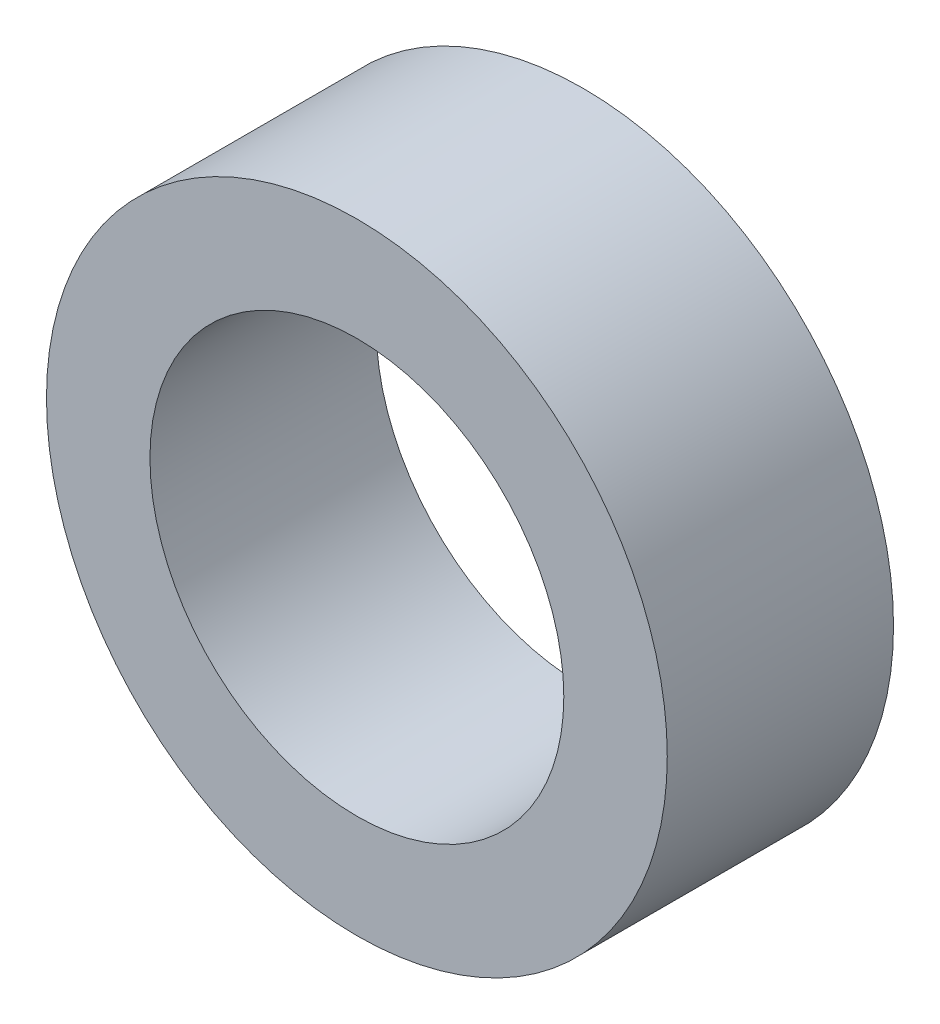
ISO-10303-21;
HEADER;
FILE_DESCRIPTION(('STEP AP214'),'2;1');
FILE_NAME('part.step','',(''),(''),'','','');
FILE_SCHEMA(('AUTOMOTIVE_DESIGN { 1 0 10303 214 1 1 1 1 }'));
ENDSEC;
DATA;
#1=APPLICATION_CONTEXT('core data for automotive mechanical design processes');
#2=APPLICATION_PROTOCOL_DEFINITION('international standard','automotive_design',2000,#1);
#3=PRODUCT_CONTEXT('',#1,'mechanical');
#4=PRODUCT('Part','Part','',(#3));
#5=PRODUCT_RELATED_PRODUCT_CATEGORY('part','',(#4));
#6=PRODUCT_DEFINITION_FORMATION('','',#4);
#7=PRODUCT_DEFINITION_CONTEXT('part definition',#1,'design');
#8=PRODUCT_DEFINITION('design','',#6,#7);
#9=PRODUCT_DEFINITION_SHAPE('','',#8);
#10=(LENGTH_UNIT() NAMED_UNIT(*) SI_UNIT(.MILLI.,.METRE.));
#11=(NAMED_UNIT(*) PLANE_ANGLE_UNIT() SI_UNIT($,.RADIAN.));
#12=(NAMED_UNIT(*) SI_UNIT($,.STERADIAN.) SOLID_ANGLE_UNIT());
#13=UNCERTAINTY_MEASURE_WITH_UNIT(LENGTH_MEASURE(1.E-05),#10,'distance_accuracy_value','');
#14=(GEOMETRIC_REPRESENTATION_CONTEXT(3) GLOBAL_UNCERTAINTY_ASSIGNED_CONTEXT((#13)) GLOBAL_UNIT_ASSIGNED_CONTEXT((#10,
#11,#12)) REPRESENTATION_CONTEXT('',''));
#15=CARTESIAN_POINT('',(0.,0.,0.));
#16=DIRECTION('',(0.,0.,1.));
#17=DIRECTION('',(1.,0.,0.));
#18=AXIS2_PLACEMENT_3D('',#15,#16,#17);
#19=CARTESIAN_POINT('',(-17.7,-16.75,1.64));
#20=DIRECTION('',(0.,0.,1.));
#21=DIRECTION('',(1.,0.,0.));
#22=AXIS2_PLACEMENT_3D('',#19,#20,#21);
#23=PLANE('',#22);
#24=CARTESIAN_POINT('',(-2.5,-31.,1.64));
#25=DIRECTION('',(0.,0.,1.));
#26=DIRECTION('',(1.,0.,0.));
#27=AXIS2_PLACEMENT_3D('',#24,#25,#26);
#28=CIRCLE('',#27,1.5);
#29=CARTESIAN_POINT('',(-1.,-31.,1.64));
#30=VERTEX_POINT('',#29);
#31=EDGE_CURVE('E50',#30,#30,#28,.T.);
#32=ORIENTED_EDGE('',*,*,#31,.F.);
#33=EDGE_LOOP('',(#32));
#34=FACE_BOUND('',#33,.T.);
#35=CARTESIAN_POINT('',(-2.5,-31.,1.64));
#36=DIRECTION('',(0.,0.,1.));
#37=DIRECTION('',(1.,0.,0.));
#38=AXIS2_PLACEMENT_3D('',#35,#36,#37);
#39=CIRCLE('',#38,2.25);
#40=CARTESIAN_POINT('',(-0.25,-31.,1.64));
#41=VERTEX_POINT('',#40);
#42=EDGE_CURVE('E11',#41,#41,#39,.T.);
#43=ORIENTED_EDGE('',*,*,#42,.T.);
#44=EDGE_LOOP('',(#43));
#45=FACE_BOUND('',#44,.T.);
#46=ADVANCED_FACE('F16',(#34,#45),#23,.T.);
#47=CARTESIAN_POINT('',(-17.7,-16.75,0.));
#48=DIRECTION('',(0.,0.,1.));
#49=DIRECTION('',(1.,0.,0.));
#50=AXIS2_PLACEMENT_3D('',#47,#48,#49);
#51=PLANE('',#50);
#52=CARTESIAN_POINT('',(-2.5,-31.,0.));
#53=DIRECTION('',(0.,0.,1.));
#54=DIRECTION('',(1.,0.,0.));
#55=AXIS2_PLACEMENT_3D('',#52,#53,#54);
#56=CIRCLE('',#55,1.5);
#57=CARTESIAN_POINT('',(-1.,-31.,0.));
#58=VERTEX_POINT('',#57);
#59=EDGE_CURVE('E44',#58,#58,#56,.T.);
#60=ORIENTED_EDGE('',*,*,#59,.T.);
#61=EDGE_LOOP('',(#60));
#62=FACE_BOUND('',#61,.T.);
#63=CARTESIAN_POINT('',(-2.5,-31.,0.));
#64=DIRECTION('',(0.,0.,1.));
#65=DIRECTION('',(1.,0.,0.));
#66=AXIS2_PLACEMENT_3D('',#63,#64,#65);
#67=CIRCLE('',#66,2.25);
#68=CARTESIAN_POINT('',(-0.25,-31.,0.));
#69=VERTEX_POINT('',#68);
#70=EDGE_CURVE('E25',#69,#69,#67,.T.);
#71=ORIENTED_EDGE('',*,*,#70,.F.);
#72=EDGE_LOOP('',(#71));
#73=FACE_BOUND('',#72,.T.);
#74=ADVANCED_FACE('F83',(#62,#73),#51,.F.);
#75=CARTESIAN_POINT('',(-2.5,-31.,1.64));
#76=DIRECTION('',(0.,0.,1.));
#77=DIRECTION('',(-1.,0.,0.));
#78=AXIS2_PLACEMENT_3D('',#75,#76,#77);
#79=CYLINDRICAL_SURFACE('',#78,2.25);
#80=ORIENTED_EDGE('',*,*,#42,.F.);
#81=EDGE_LOOP('',(#80));
#82=FACE_BOUND('',#81,.T.);
#83=ORIENTED_EDGE('',*,*,#70,.T.);
#84=EDGE_LOOP('',(#83));
#85=FACE_BOUND('',#84,.T.);
#86=ADVANCED_FACE('F71',(#82,#85),#79,.T.);
#87=CARTESIAN_POINT('',(-2.5,-31.,1.64));
#88=DIRECTION('',(0.,0.,1.));
#89=DIRECTION('',(-1.,0.,0.));
#90=AXIS2_PLACEMENT_3D('',#87,#88,#89);
#91=CYLINDRICAL_SURFACE('',#90,1.5);
#92=ORIENTED_EDGE('',*,*,#31,.T.);
#93=EDGE_LOOP('',(#92));
#94=FACE_BOUND('',#93,.T.);
#95=ORIENTED_EDGE('',*,*,#59,.F.);
#96=EDGE_LOOP('',(#95));
#97=FACE_BOUND('',#96,.T.);
#98=ADVANCED_FACE('F51',(#94,#97),#91,.F.);
#99=CLOSED_SHELL('',(#46,#74,#86,#98));
#100=MANIFOLD_SOLID_BREP('B1',#99);
#101=ADVANCED_BREP_SHAPE_REPRESENTATION('',(#18,#100),#14);
#102=SHAPE_DEFINITION_REPRESENTATION(#9,#101);
ENDSEC;
END-ISO-10303-21;
